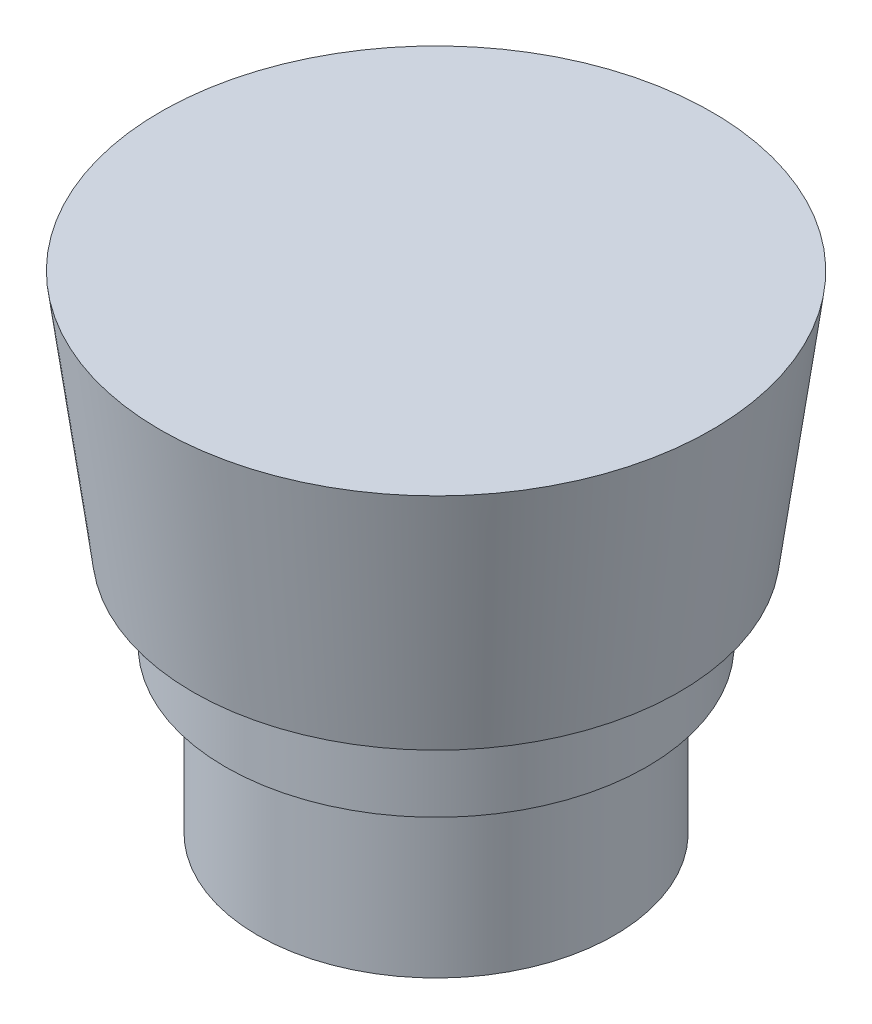
ISO-10303-21;
HEADER;
FILE_DESCRIPTION(('STEP AP214'),'2;1');
FILE_NAME('part.step','',(''),(''),'','','');
FILE_SCHEMA(('AUTOMOTIVE_DESIGN { 1 0 10303 214 1 1 1 1 }'));
ENDSEC;
DATA;
#1=APPLICATION_CONTEXT('core data for automotive mechanical design processes');
#2=APPLICATION_PROTOCOL_DEFINITION('international standard','automotive_design',2000,#1);
#3=PRODUCT_CONTEXT('',#1,'mechanical');
#4=PRODUCT('Part','Part','',(#3));
#5=PRODUCT_RELATED_PRODUCT_CATEGORY('part','',(#4));
#6=PRODUCT_DEFINITION_FORMATION('','',#4);
#7=PRODUCT_DEFINITION_CONTEXT('part definition',#1,'design');
#8=PRODUCT_DEFINITION('design','',#6,#7);
#9=PRODUCT_DEFINITION_SHAPE('','',#8);
#10=(LENGTH_UNIT() NAMED_UNIT(*) SI_UNIT(.MILLI.,.METRE.));
#11=(NAMED_UNIT(*) PLANE_ANGLE_UNIT() SI_UNIT($,.RADIAN.));
#12=(NAMED_UNIT(*) SI_UNIT($,.STERADIAN.) SOLID_ANGLE_UNIT());
#13=UNCERTAINTY_MEASURE_WITH_UNIT(LENGTH_MEASURE(1.E-05),#10,'distance_accuracy_value','');
#14=(GEOMETRIC_REPRESENTATION_CONTEXT(3) GLOBAL_UNCERTAINTY_ASSIGNED_CONTEXT((#13)) GLOBAL_UNIT_ASSIGNED_CONTEXT((#10,
#11,#12)) REPRESENTATION_CONTEXT('',''));
#15=CARTESIAN_POINT('',(0.,0.,0.));
#16=DIRECTION('',(0.,0.,1.));
#17=DIRECTION('',(1.,0.,0.));
#18=AXIS2_PLACEMENT_3D('',#15,#16,#17);
#19=CARTESIAN_POINT('',(0.,-30.5352727272727,0.));
#20=DIRECTION('',(0.,1.,0.));
#21=DIRECTION('',(0.,0.,1.));
#22=AXIS2_PLACEMENT_3D('',#19,#20,#21);
#23=PLANE('',#22);
#24=CARTESIAN_POINT('',(0.,-30.5352727272727,0.));
#25=DIRECTION('',(0.,1.,0.));
#26=DIRECTION('',(0.,0.,1.));
#27=AXIS2_PLACEMENT_3D('',#24,#25,#26);
#28=CIRCLE('',#27,11.);
#29=CARTESIAN_POINT('',(0.,-30.5352727272727,11.));
#30=VERTEX_POINT('',#29);
#31=EDGE_CURVE('E10',#30,#30,#28,.T.);
#32=ORIENTED_EDGE('',*,*,#31,.F.);
#33=EDGE_LOOP('',(#32));
#34=FACE_BOUND('',#33,.T.);
#35=ADVANCED_FACE('F30',(#34),#23,.F.);
#36=CARTESIAN_POINT('',(0.,48.227012987013,0.));
#37=DIRECTION('',(0.,1.,0.));
#38=DIRECTION('',(0.,0.,1.));
#39=AXIS2_PLACEMENT_3D('',#36,#37,#38);
#40=CYLINDRICAL_SURFACE('',#39,11.);
#41=CARTESIAN_POINT('',(0.,-20.5352727272727,0.));
#42=DIRECTION('',(0.,1.,0.));
#43=DIRECTION('',(0.,0.,1.));
#44=AXIS2_PLACEMENT_3D('',#41,#42,#43);
#45=CIRCLE('',#44,11.);
#46=CARTESIAN_POINT('',(0.,-20.5352727272727,11.));
#47=VERTEX_POINT('',#46);
#48=EDGE_CURVE('E36',#47,#47,#45,.T.);
#49=ORIENTED_EDGE('',*,*,#48,.F.);
#50=EDGE_LOOP('',(#49));
#51=FACE_BOUND('',#50,.T.);
#52=ORIENTED_EDGE('',*,*,#31,.T.);
#53=EDGE_LOOP('',(#52));
#54=FACE_BOUND('',#53,.T.);
#55=ADVANCED_FACE('F78',(#51,#54),#40,.T.);
#56=CARTESIAN_POINT('',(13.,-20.5352727272727,0.));
#57=DIRECTION('',(0.,1.,0.));
#58=DIRECTION('',(0.,0.,1.));
#59=AXIS2_PLACEMENT_3D('',#56,#57,#58);
#60=PLANE('',#59);
#61=CARTESIAN_POINT('',(0.,-20.5352727272727,0.));
#62=DIRECTION('',(0.,1.,0.));
#63=DIRECTION('',(0.,0.,1.));
#64=AXIS2_PLACEMENT_3D('',#61,#62,#63);
#65=CIRCLE('',#64,13.);
#66=CARTESIAN_POINT('',(0.,-20.5352727272727,13.));
#67=VERTEX_POINT('',#66);
#68=EDGE_CURVE('E40',#67,#67,#65,.T.);
#69=ORIENTED_EDGE('',*,*,#68,.F.);
#70=EDGE_LOOP('',(#69));
#71=FACE_BOUND('',#70,.T.);
#72=ORIENTED_EDGE('',*,*,#48,.T.);
#73=EDGE_LOOP('',(#72));
#74=FACE_BOUND('',#73,.T.);
#75=ADVANCED_FACE('F73',(#71,#74),#60,.F.);
#76=CARTESIAN_POINT('',(0.,48.227012987013,0.));
#77=DIRECTION('',(0.,1.,0.));
#78=DIRECTION('',(0.,0.,1.));
#79=AXIS2_PLACEMENT_3D('',#76,#77,#78);
#80=CYLINDRICAL_SURFACE('',#79,13.);
#81=CARTESIAN_POINT('',(0.,-15.5352727272727,0.));
#82=DIRECTION('',(0.,1.,0.));
#83=DIRECTION('',(0.,0.,1.));
#84=AXIS2_PLACEMENT_3D('',#81,#82,#83);
#85=CIRCLE('',#84,13.);
#86=CARTESIAN_POINT('',(0.,-15.5352727272727,13.));
#87=VERTEX_POINT('',#86);
#88=EDGE_CURVE('E44',#87,#87,#85,.T.);
#89=ORIENTED_EDGE('',*,*,#88,.F.);
#90=EDGE_LOOP('',(#89));
#91=FACE_BOUND('',#90,.T.);
#92=ORIENTED_EDGE('',*,*,#68,.T.);
#93=EDGE_LOOP('',(#92));
#94=FACE_BOUND('',#93,.T.);
#95=ADVANCED_FACE('F67',(#91,#94),#80,.T.);
#96=CARTESIAN_POINT('',(13.,-15.5352727272727,0.));
#97=DIRECTION('',(0.,1.,0.));
#98=DIRECTION('',(0.,0.,1.));
#99=AXIS2_PLACEMENT_3D('',#96,#97,#98);
#100=PLANE('',#99);
#101=CARTESIAN_POINT('',(0.,-15.5352727272727,0.));
#102=DIRECTION('',(0.,1.,0.));
#103=DIRECTION('',(0.,0.,1.));
#104=AXIS2_PLACEMENT_3D('',#101,#102,#103);
#105=CIRCLE('',#104,15.);
#106=CARTESIAN_POINT('',(0.,-15.5352727272727,15.));
#107=VERTEX_POINT('',#106);
#108=EDGE_CURVE('E49',#107,#107,#105,.T.);
#109=ORIENTED_EDGE('',*,*,#108,.F.);
#110=EDGE_LOOP('',(#109));
#111=FACE_BOUND('',#110,.T.);
#112=ORIENTED_EDGE('',*,*,#88,.T.);
#113=EDGE_LOOP('',(#112));
#114=FACE_BOUND('',#113,.T.);
#115=ADVANCED_FACE('F61',(#111,#114),#100,.F.);
#116=CARTESIAN_POINT('',(0.,-15.5352727272727,0.));
#117=DIRECTION('',(0.,1.,0.));
#118=DIRECTION('',(0.,0.,1.));
#119=AXIS2_PLACEMENT_3D('',#116,#117,#118);
#120=CONICAL_SURFACE('',#119,15.,0.132551532296674);
#121=CARTESIAN_POINT('',(0.,-0.535272727272731,0.));
#122=DIRECTION('',(0.,1.,0.));
#123=DIRECTION('',(0.,0.,1.));
#124=AXIS2_PLACEMENT_3D('',#121,#122,#123);
#125=CIRCLE('',#124,17.);
#126=CARTESIAN_POINT('',(0.,-0.535272727272731,17.));
#127=VERTEX_POINT('',#126);
#128=EDGE_CURVE('E52',#127,#127,#125,.T.);
#129=ORIENTED_EDGE('',*,*,#128,.F.);
#130=EDGE_LOOP('',(#129));
#131=FACE_BOUND('',#130,.T.);
#132=ORIENTED_EDGE('',*,*,#108,.T.);
#133=EDGE_LOOP('',(#132));
#134=FACE_BOUND('',#133,.T.);
#135=ADVANCED_FACE('F58',(#131,#134),#120,.T.);
#136=CARTESIAN_POINT('',(17.,-0.535272727272732,0.));
#137=DIRECTION('',(0.,-1.,0.));
#138=DIRECTION('',(0.,0.,-1.));
#139=AXIS2_PLACEMENT_3D('',#136,#137,#138);
#140=PLANE('',#139);
#141=ORIENTED_EDGE('',*,*,#128,.T.);
#142=EDGE_LOOP('',(#141));
#143=FACE_BOUND('',#142,.T.);
#144=ADVANCED_FACE('F56',(#143),#140,.F.);
#145=CLOSED_SHELL('',(#35,#55,#75,#95,#115,#135,#144));
#146=MANIFOLD_SOLID_BREP('B2',#145);
#147=ADVANCED_BREP_SHAPE_REPRESENTATION('',(#18,#146),#14);
#148=SHAPE_DEFINITION_REPRESENTATION(#9,#147);
ENDSEC;
END-ISO-10303-21;
